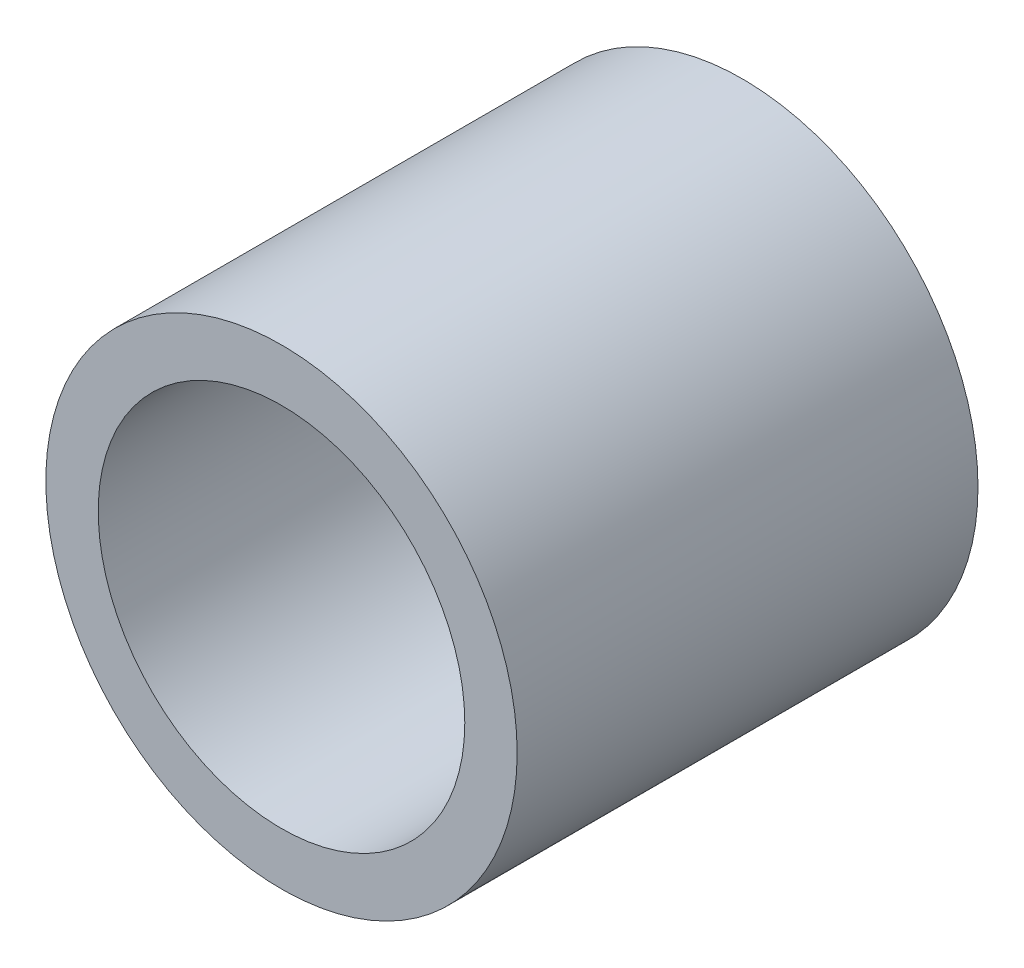
ISO-10303-21;
HEADER;
FILE_DESCRIPTION(('STEP AP214'),'2;1');
FILE_NAME('part.step','',(''),(''),'','','');
FILE_SCHEMA(('AUTOMOTIVE_DESIGN { 1 0 10303 214 1 1 1 1 }'));
ENDSEC;
DATA;
#1=APPLICATION_CONTEXT('core data for automotive mechanical design processes');
#2=APPLICATION_PROTOCOL_DEFINITION('international standard','automotive_design',2000,#1);
#3=PRODUCT_CONTEXT('',#1,'mechanical');
#4=PRODUCT('Part','Part','',(#3));
#5=PRODUCT_RELATED_PRODUCT_CATEGORY('part','',(#4));
#6=PRODUCT_DEFINITION_FORMATION('','',#4);
#7=PRODUCT_DEFINITION_CONTEXT('part definition',#1,'design');
#8=PRODUCT_DEFINITION('design','',#6,#7);
#9=PRODUCT_DEFINITION_SHAPE('','',#8);
#10=(LENGTH_UNIT() NAMED_UNIT(*) SI_UNIT(.MILLI.,.METRE.));
#11=(NAMED_UNIT(*) PLANE_ANGLE_UNIT() SI_UNIT($,.RADIAN.));
#12=(NAMED_UNIT(*) SI_UNIT($,.STERADIAN.) SOLID_ANGLE_UNIT());
#13=UNCERTAINTY_MEASURE_WITH_UNIT(LENGTH_MEASURE(1.E-05),#10,'distance_accuracy_value','');
#14=(GEOMETRIC_REPRESENTATION_CONTEXT(3) GLOBAL_UNCERTAINTY_ASSIGNED_CONTEXT((#13)) GLOBAL_UNIT_ASSIGNED_CONTEXT((#10,
#11,#12)) REPRESENTATION_CONTEXT('',''));
#15=CARTESIAN_POINT('',(0.,0.,0.));
#16=DIRECTION('',(0.,0.,1.));
#17=DIRECTION('',(1.,0.,0.));
#18=AXIS2_PLACEMENT_3D('',#15,#16,#17);
#19=CARTESIAN_POINT('',(0.,0.,11.));
#20=DIRECTION('',(0.,0.,1.));
#21=DIRECTION('',(1.,0.,0.));
#22=AXIS2_PLACEMENT_3D('',#19,#20,#21);
#23=PLANE('',#22);
#24=CARTESIAN_POINT('',(0.,0.,11.));
#25=DIRECTION('',(0.,0.,1.));
#26=DIRECTION('',(1.,0.,0.));
#27=AXIS2_PLACEMENT_3D('',#24,#25,#26);
#28=CIRCLE('',#27,5.625);
#29=CARTESIAN_POINT('',(5.625,0.,11.));
#30=VERTEX_POINT('',#29);
#31=EDGE_CURVE('E10',#30,#30,#28,.T.);
#32=ORIENTED_EDGE('',*,*,#31,.T.);
#33=EDGE_LOOP('',(#32));
#34=FACE_BOUND('',#33,.T.);
#35=CARTESIAN_POINT('',(0.,0.,11.));
#36=DIRECTION('',(0.,0.,1.));
#37=DIRECTION('',(1.,0.,0.));
#38=AXIS2_PLACEMENT_3D('',#35,#36,#37);
#39=CIRCLE('',#38,4.375);
#40=CARTESIAN_POINT('',(4.375,0.,11.));
#41=VERTEX_POINT('',#40);
#42=EDGE_CURVE('E40',#41,#41,#39,.T.);
#43=ORIENTED_EDGE('',*,*,#42,.F.);
#44=EDGE_LOOP('',(#43));
#45=FACE_BOUND('',#44,.T.);
#46=ADVANCED_FACE('F29',(#34,#45),#23,.T.);
#47=CARTESIAN_POINT('',(0.,0.,0.));
#48=DIRECTION('',(0.,0.,1.));
#49=DIRECTION('',(1.,0.,0.));
#50=AXIS2_PLACEMENT_3D('',#47,#48,#49);
#51=PLANE('',#50);
#52=CARTESIAN_POINT('',(0.,0.,0.));
#53=DIRECTION('',(0.,0.,1.));
#54=DIRECTION('',(1.,0.,0.));
#55=AXIS2_PLACEMENT_3D('',#52,#53,#54);
#56=CIRCLE('',#55,5.625);
#57=CARTESIAN_POINT('',(5.625,0.,0.));
#58=VERTEX_POINT('',#57);
#59=EDGE_CURVE('E33',#58,#58,#56,.T.);
#60=ORIENTED_EDGE('',*,*,#59,.F.);
#61=EDGE_LOOP('',(#60));
#62=FACE_BOUND('',#61,.T.);
#63=CARTESIAN_POINT('',(0.,0.,0.));
#64=DIRECTION('',(0.,0.,1.));
#65=DIRECTION('',(1.,0.,0.));
#66=AXIS2_PLACEMENT_3D('',#63,#64,#65);
#67=CIRCLE('',#66,4.375);
#68=CARTESIAN_POINT('',(4.375,0.,0.));
#69=VERTEX_POINT('',#68);
#70=EDGE_CURVE('E42',#69,#69,#67,.T.);
#71=ORIENTED_EDGE('',*,*,#70,.T.);
#72=EDGE_LOOP('',(#71));
#73=FACE_BOUND('',#72,.T.);
#74=ADVANCED_FACE('F52',(#62,#73),#51,.F.);
#75=CARTESIAN_POINT('',(0.,0.,11.));
#76=DIRECTION('',(0.,0.,-1.));
#77=DIRECTION('',(-1.,0.,0.));
#78=AXIS2_PLACEMENT_3D('',#75,#76,#77);
#79=CYLINDRICAL_SURFACE('',#78,5.625);
#80=ORIENTED_EDGE('',*,*,#31,.F.);
#81=EDGE_LOOP('',(#80));
#82=FACE_BOUND('',#81,.T.);
#83=ORIENTED_EDGE('',*,*,#59,.T.);
#84=EDGE_LOOP('',(#83));
#85=FACE_BOUND('',#84,.T.);
#86=ADVANCED_FACE('F31',(#82,#85),#79,.T.);
#87=CARTESIAN_POINT('',(0.,0.,11.));
#88=DIRECTION('',(0.,0.,-1.));
#89=DIRECTION('',(-1.,0.,0.));
#90=AXIS2_PLACEMENT_3D('',#87,#88,#89);
#91=CYLINDRICAL_SURFACE('',#90,4.375);
#92=ORIENTED_EDGE('',*,*,#42,.T.);
#93=EDGE_LOOP('',(#92));
#94=FACE_BOUND('',#93,.T.);
#95=ORIENTED_EDGE('',*,*,#70,.F.);
#96=EDGE_LOOP('',(#95));
#97=FACE_BOUND('',#96,.T.);
#98=ADVANCED_FACE('F48',(#94,#97),#91,.F.);
#99=CLOSED_SHELL('',(#46,#74,#86,#98));
#100=MANIFOLD_SOLID_BREP('B2',#99);
#101=ADVANCED_BREP_SHAPE_REPRESENTATION('',(#18,#100),#14);
#102=SHAPE_DEFINITION_REPRESENTATION(#9,#101);
ENDSEC;
END-ISO-10303-21;
